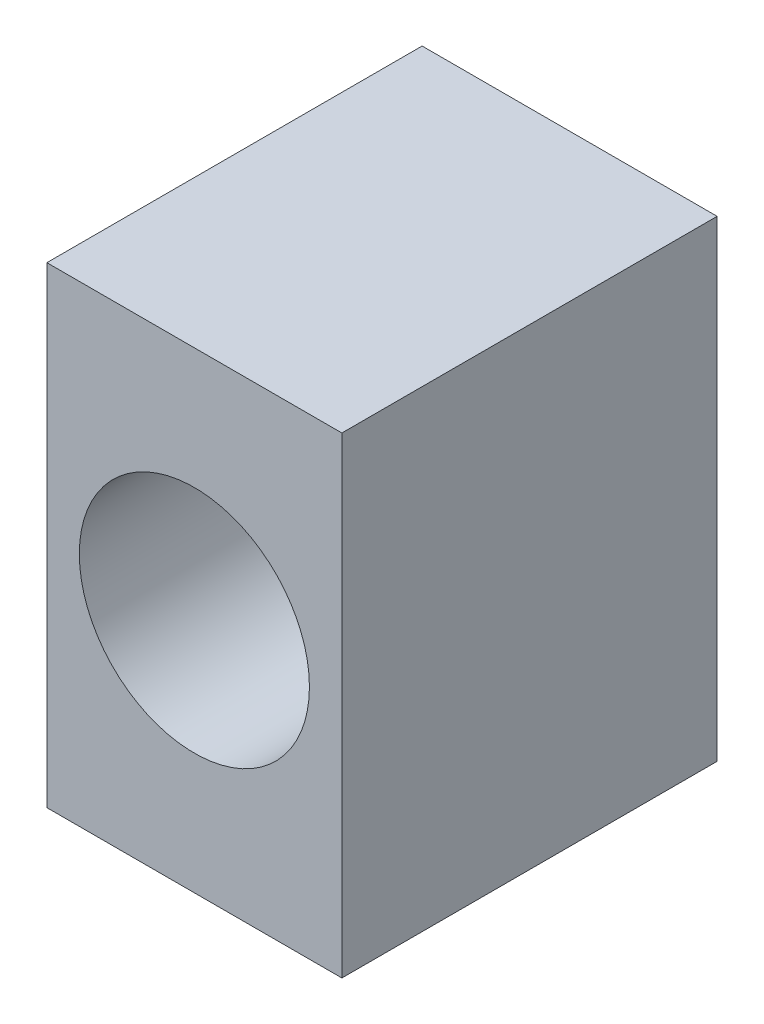
ISO-10303-21;
HEADER;
FILE_DESCRIPTION(('STEP AP214'),'2;1');
FILE_NAME('part.step','',(''),(''),'','','');
FILE_SCHEMA(('AUTOMOTIVE_DESIGN { 1 0 10303 214 1 1 1 1 }'));
ENDSEC;
DATA;
#1=APPLICATION_CONTEXT('core data for automotive mechanical design processes');
#2=APPLICATION_PROTOCOL_DEFINITION('international standard','automotive_design',2000,#1);
#3=PRODUCT_CONTEXT('',#1,'mechanical');
#4=PRODUCT('Part','Part','',(#3));
#5=PRODUCT_RELATED_PRODUCT_CATEGORY('part','',(#4));
#6=PRODUCT_DEFINITION_FORMATION('','',#4);
#7=PRODUCT_DEFINITION_CONTEXT('part definition',#1,'design');
#8=PRODUCT_DEFINITION('design','',#6,#7);
#9=PRODUCT_DEFINITION_SHAPE('','',#8);
#10=(LENGTH_UNIT() NAMED_UNIT(*) SI_UNIT(.MILLI.,.METRE.));
#11=(NAMED_UNIT(*) PLANE_ANGLE_UNIT() SI_UNIT($,.RADIAN.));
#12=(NAMED_UNIT(*) SI_UNIT($,.STERADIAN.) SOLID_ANGLE_UNIT());
#13=UNCERTAINTY_MEASURE_WITH_UNIT(LENGTH_MEASURE(1.E-05),#10,'distance_accuracy_value','');
#14=(GEOMETRIC_REPRESENTATION_CONTEXT(3) GLOBAL_UNCERTAINTY_ASSIGNED_CONTEXT((#13)) GLOBAL_UNIT_ASSIGNED_CONTEXT((#10,
#11,#12)) REPRESENTATION_CONTEXT('',''));
#15=CARTESIAN_POINT('',(0.,0.,0.));
#16=DIRECTION('',(0.,0.,1.));
#17=DIRECTION('',(1.,0.,0.));
#18=AXIS2_PLACEMENT_3D('',#15,#16,#17);
#19=CARTESIAN_POINT('',(1.25,2.,3.18));
#20=DIRECTION('',(-1.,0.,0.));
#21=DIRECTION('',(0.,-1.,0.));
#22=AXIS2_PLACEMENT_3D('',#19,#20,#21);
#23=PLANE('',#22);
#24=DIRECTION('',(0.,1.,0.));
#25=VECTOR('',#24,1.);
#26=CARTESIAN_POINT('',(1.25,2.,0.));
#27=LINE('',#26,#25);
#28=CARTESIAN_POINT('',(1.25,-2.,0.));
#29=VERTEX_POINT('',#28);
#30=CARTESIAN_POINT('',(1.25,2.,0.));
#31=VERTEX_POINT('',#30);
#32=EDGE_CURVE('E107',#29,#31,#27,.T.);
#33=ORIENTED_EDGE('',*,*,#32,.T.);
#34=DIRECTION('',(0.,0.,-1.));
#35=VECTOR('',#34,1.);
#36=CARTESIAN_POINT('',(1.25,2.,3.18));
#37=LINE('',#36,#35);
#38=CARTESIAN_POINT('',(1.25,2.,3.18));
#39=VERTEX_POINT('',#38);
#40=EDGE_CURVE('E11',#39,#31,#37,.T.);
#41=ORIENTED_EDGE('',*,*,#40,.F.);
#42=DIRECTION('',(0.,1.,0.));
#43=VECTOR('',#42,1.);
#44=CARTESIAN_POINT('',(1.25,2.,3.18));
#45=LINE('',#44,#43);
#46=CARTESIAN_POINT('',(1.25,-2.,3.18));
#47=VERTEX_POINT('',#46);
#48=EDGE_CURVE('E91',#47,#39,#45,.T.);
#49=ORIENTED_EDGE('',*,*,#48,.F.);
#50=DIRECTION('',(0.,0.,-1.));
#51=VECTOR('',#50,1.);
#52=CARTESIAN_POINT('',(1.25,-2.,3.18));
#53=LINE('',#52,#51);
#54=EDGE_CURVE('E103',#47,#29,#53,.T.);
#55=ORIENTED_EDGE('',*,*,#54,.T.);
#56=EDGE_LOOP('',(#33,#41,#49,#55));
#57=FACE_BOUND('',#56,.T.);
#58=ADVANCED_FACE('F39',(#57),#23,.F.);
#59=CARTESIAN_POINT('',(-1.25,2.,3.18));
#60=DIRECTION('',(0.,-1.,0.));
#61=DIRECTION('',(0.,0.,-1.));
#62=AXIS2_PLACEMENT_3D('',#59,#60,#61);
#63=PLANE('',#62);
#64=DIRECTION('',(-1.,0.,0.));
#65=VECTOR('',#64,1.);
#66=CARTESIAN_POINT('',(-1.25,2.,0.));
#67=LINE('',#66,#65);
#68=CARTESIAN_POINT('',(-1.25,2.,0.));
#69=VERTEX_POINT('',#68);
#70=EDGE_CURVE('E96',#31,#69,#67,.T.);
#71=ORIENTED_EDGE('',*,*,#70,.T.);
#72=DIRECTION('',(0.,0.,-1.));
#73=VECTOR('',#72,1.);
#74=CARTESIAN_POINT('',(-1.25,2.,3.18));
#75=LINE('',#74,#73);
#76=CARTESIAN_POINT('',(-1.25,2.,3.18));
#77=VERTEX_POINT('',#76);
#78=EDGE_CURVE('E48',#77,#69,#75,.T.);
#79=ORIENTED_EDGE('',*,*,#78,.F.);
#80=DIRECTION('',(-1.,0.,0.));
#81=VECTOR('',#80,1.);
#82=CARTESIAN_POINT('',(-1.25,2.,3.18));
#83=LINE('',#82,#81);
#84=EDGE_CURVE('E86',#39,#77,#83,.T.);
#85=ORIENTED_EDGE('',*,*,#84,.F.);
#86=ORIENTED_EDGE('',*,*,#40,.T.);
#87=EDGE_LOOP('',(#71,#79,#85,#86));
#88=FACE_BOUND('',#87,.T.);
#89=ADVANCED_FACE('F95',(#88),#63,.F.);
#90=CARTESIAN_POINT('',(-1.25,2.,3.18));
#91=DIRECTION('',(1.,0.,0.));
#92=DIRECTION('',(0.,1.,0.));
#93=AXIS2_PLACEMENT_3D('',#90,#91,#92);
#94=PLANE('',#93);
#95=DIRECTION('',(0.,-1.,0.));
#96=VECTOR('',#95,1.);
#97=CARTESIAN_POINT('',(-1.25,2.,0.));
#98=LINE('',#97,#96);
#99=CARTESIAN_POINT('',(-1.25,-2.,0.));
#100=VERTEX_POINT('',#99);
#101=EDGE_CURVE('E73',#69,#100,#98,.T.);
#102=ORIENTED_EDGE('',*,*,#101,.T.);
#103=DIRECTION('',(0.,0.,-1.));
#104=VECTOR('',#103,1.);
#105=CARTESIAN_POINT('',(-1.25,-2.,3.18));
#106=LINE('',#105,#104);
#107=CARTESIAN_POINT('',(-1.25,-2.,3.18));
#108=VERTEX_POINT('',#107);
#109=EDGE_CURVE('E98',#108,#100,#106,.T.);
#110=ORIENTED_EDGE('',*,*,#109,.F.);
#111=DIRECTION('',(0.,-1.,0.));
#112=VECTOR('',#111,1.);
#113=CARTESIAN_POINT('',(-1.25,2.,3.18));
#114=LINE('',#113,#112);
#115=EDGE_CURVE('E89',#77,#108,#114,.T.);
#116=ORIENTED_EDGE('',*,*,#115,.F.);
#117=ORIENTED_EDGE('',*,*,#78,.T.);
#118=EDGE_LOOP('',(#102,#110,#116,#117));
#119=FACE_BOUND('',#118,.T.);
#120=ADVANCED_FACE('F99',(#119),#94,.F.);
#121=CARTESIAN_POINT('',(-1.25,-2.,3.18));
#122=DIRECTION('',(0.,1.,0.));
#123=DIRECTION('',(0.,0.,1.));
#124=AXIS2_PLACEMENT_3D('',#121,#122,#123);
#125=PLANE('',#124);
#126=DIRECTION('',(1.,0.,0.));
#127=VECTOR('',#126,1.);
#128=CARTESIAN_POINT('',(-1.25,-2.,0.));
#129=LINE('',#128,#127);
#130=EDGE_CURVE('E79',#100,#29,#129,.T.);
#131=ORIENTED_EDGE('',*,*,#130,.T.);
#132=ORIENTED_EDGE('',*,*,#54,.F.);
#133=DIRECTION('',(1.,0.,0.));
#134=VECTOR('',#133,1.);
#135=CARTESIAN_POINT('',(-1.25,-2.,3.18));
#136=LINE('',#135,#134);
#137=EDGE_CURVE('E56',#108,#47,#136,.T.);
#138=ORIENTED_EDGE('',*,*,#137,.F.);
#139=ORIENTED_EDGE('',*,*,#109,.T.);
#140=EDGE_LOOP('',(#131,#132,#138,#139));
#141=FACE_BOUND('',#140,.T.);
#142=ADVANCED_FACE('F121',(#141),#125,.F.);
#143=CARTESIAN_POINT('',(0.,0.,3.18));
#144=DIRECTION('',(0.,0.,1.));
#145=DIRECTION('',(1.,0.,0.));
#146=AXIS2_PLACEMENT_3D('',#143,#144,#145);
#147=PLANE('',#146);
#148=CARTESIAN_POINT('',(0.,0.,3.18));
#149=DIRECTION('',(0.,0.,1.));
#150=DIRECTION('',(1.,0.,0.));
#151=AXIS2_PLACEMENT_3D('',#148,#149,#150);
#152=CIRCLE('',#151,0.975);
#153=CARTESIAN_POINT('',(0.975,0.,3.18));
#154=VERTEX_POINT('',#153);
#155=EDGE_CURVE('E128',#154,#154,#152,.T.);
#156=ORIENTED_EDGE('',*,*,#155,.F.);
#157=EDGE_LOOP('',(#156));
#158=FACE_BOUND('',#157,.T.);
#159=ORIENTED_EDGE('',*,*,#48,.T.);
#160=ORIENTED_EDGE('',*,*,#84,.T.);
#161=ORIENTED_EDGE('',*,*,#115,.T.);
#162=ORIENTED_EDGE('',*,*,#137,.T.);
#163=EDGE_LOOP('',(#159,#160,#161,#162));
#164=FACE_BOUND('',#163,.T.);
#165=ADVANCED_FACE('F87',(#158,#164),#147,.T.);
#166=CARTESIAN_POINT('',(0.,0.,0.));
#167=DIRECTION('',(0.,0.,1.));
#168=DIRECTION('',(1.,0.,0.));
#169=AXIS2_PLACEMENT_3D('',#166,#167,#168);
#170=PLANE('',#169);
#171=CARTESIAN_POINT('',(0.,0.,0.));
#172=DIRECTION('',(0.,0.,1.));
#173=DIRECTION('',(1.,0.,0.));
#174=AXIS2_PLACEMENT_3D('',#171,#172,#173);
#175=CIRCLE('',#174,0.975);
#176=CARTESIAN_POINT('',(0.975,0.,0.));
#177=VERTEX_POINT('',#176);
#178=EDGE_CURVE('E111',#177,#177,#175,.T.);
#179=ORIENTED_EDGE('',*,*,#178,.T.);
#180=EDGE_LOOP('',(#179));
#181=FACE_BOUND('',#180,.T.);
#182=ORIENTED_EDGE('',*,*,#32,.F.);
#183=ORIENTED_EDGE('',*,*,#130,.F.);
#184=ORIENTED_EDGE('',*,*,#101,.F.);
#185=ORIENTED_EDGE('',*,*,#70,.F.);
#186=EDGE_LOOP('',(#182,#183,#184,#185));
#187=FACE_BOUND('',#186,.T.);
#188=ADVANCED_FACE('F124',(#181,#187),#170,.F.);
#189=CARTESIAN_POINT('',(0.,0.,0.));
#190=DIRECTION('',(0.,0.,1.));
#191=DIRECTION('',(1.,0.,0.));
#192=AXIS2_PLACEMENT_3D('',#189,#190,#191);
#193=CYLINDRICAL_SURFACE('',#192,0.975);
#194=ORIENTED_EDGE('',*,*,#178,.F.);
#195=EDGE_LOOP('',(#194));
#196=FACE_BOUND('',#195,.T.);
#197=ORIENTED_EDGE('',*,*,#155,.T.);
#198=EDGE_LOOP('',(#197));
#199=FACE_BOUND('',#198,.T.);
#200=ADVANCED_FACE('F137',(#196,#199),#193,.F.);
#201=CLOSED_SHELL('',(#58,#89,#120,#142,#165,#188,#200));
#202=MANIFOLD_SOLID_BREP('B2',#201);
#203=ADVANCED_BREP_SHAPE_REPRESENTATION('',(#18,#202),#14);
#204=SHAPE_DEFINITION_REPRESENTATION(#9,#203);
ENDSEC;
END-ISO-10303-21;
